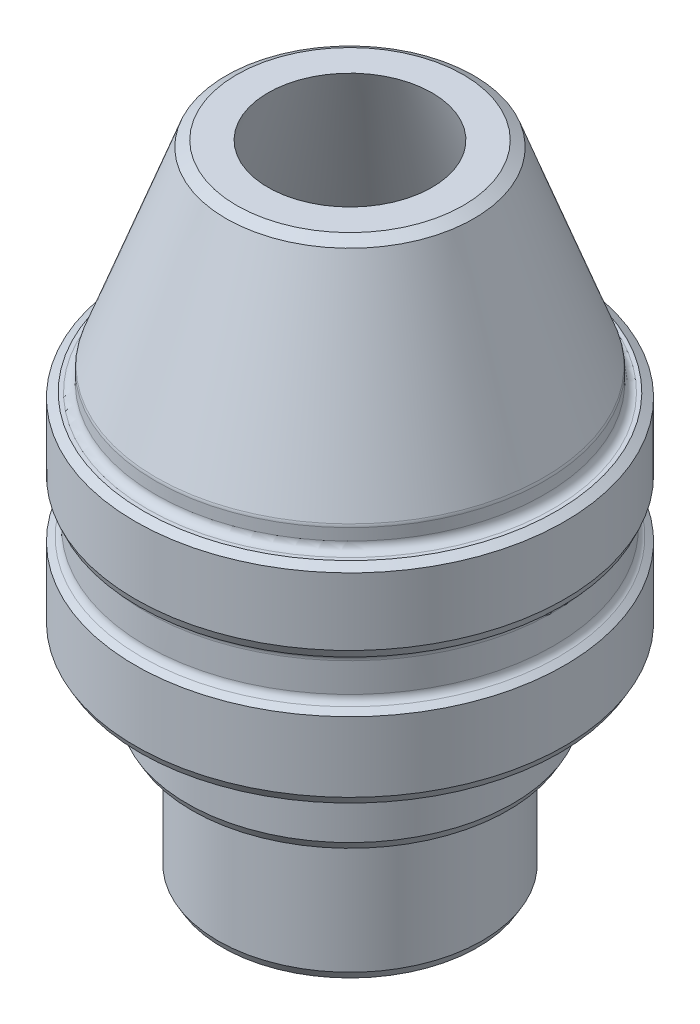
ISO-10303-21;
HEADER;
FILE_DESCRIPTION(('STEP AP214'),'2;1');
FILE_NAME('part.step','',(''),(''),'','','');
FILE_SCHEMA(('AUTOMOTIVE_DESIGN { 1 0 10303 214 1 1 1 1 }'));
ENDSEC;
DATA;
#1=APPLICATION_CONTEXT('core data for automotive mechanical design processes');
#2=APPLICATION_PROTOCOL_DEFINITION('international standard','automotive_design',2000,#1);
#3=PRODUCT_CONTEXT('',#1,'mechanical');
#4=PRODUCT('Part','Part','',(#3));
#5=PRODUCT_RELATED_PRODUCT_CATEGORY('part','',(#4));
#6=PRODUCT_DEFINITION_FORMATION('','',#4);
#7=PRODUCT_DEFINITION_CONTEXT('part definition',#1,'design');
#8=PRODUCT_DEFINITION('design','',#6,#7);
#9=PRODUCT_DEFINITION_SHAPE('','',#8);
#10=(LENGTH_UNIT() NAMED_UNIT(*) SI_UNIT(.MILLI.,.METRE.));
#11=(NAMED_UNIT(*) PLANE_ANGLE_UNIT() SI_UNIT($,.RADIAN.));
#12=(NAMED_UNIT(*) SI_UNIT($,.STERADIAN.) SOLID_ANGLE_UNIT());
#13=UNCERTAINTY_MEASURE_WITH_UNIT(LENGTH_MEASURE(1.E-05),#10,'distance_accuracy_value','');
#14=(GEOMETRIC_REPRESENTATION_CONTEXT(3) GLOBAL_UNCERTAINTY_ASSIGNED_CONTEXT((#13)) GLOBAL_UNIT_ASSIGNED_CONTEXT((#10,
#11,#12)) REPRESENTATION_CONTEXT('',''));
#15=CARTESIAN_POINT('',(0.,0.,0.));
#16=DIRECTION('',(0.,0.,1.));
#17=DIRECTION('',(1.,0.,0.));
#18=AXIS2_PLACEMENT_3D('',#15,#16,#17);
#19=CARTESIAN_POINT('',(4.318,22.5552,0.));
#20=DIRECTION('',(0.,1.,0.));
#21=DIRECTION('',(0.,0.,1.));
#22=AXIS2_PLACEMENT_3D('',#19,#20,#21);
#23=PLANE('',#22);
#24=CARTESIAN_POINT('',(0.,22.5552,0.));
#25=DIRECTION('',(0.,1.,0.));
#26=DIRECTION('',(0.,0.,1.));
#27=AXIS2_PLACEMENT_3D('',#24,#25,#26);
#28=CIRCLE('',#27,4.02265116279069);
#29=CARTESIAN_POINT('',(0.,22.5552,4.02265116279069));
#30=VERTEX_POINT('',#29);
#31=EDGE_CURVE('E10',#30,#30,#28,.T.);
#32=ORIENTED_EDGE('',*,*,#31,.T.);
#33=EDGE_LOOP('',(#32));
#34=FACE_BOUND('',#33,.T.);
#35=CARTESIAN_POINT('',(0.,22.5552,0.));
#36=DIRECTION('',(0.,-1.,0.));
#37=DIRECTION('',(0.,0.,-1.));
#38=AXIS2_PLACEMENT_3D('',#35,#36,#37);
#39=CIRCLE('',#38,2.91010643835145);
#40=CARTESIAN_POINT('',(0.,22.5552,-2.91010643835145));
#41=VERTEX_POINT('',#40);
#42=EDGE_CURVE('E110',#41,#41,#39,.T.);
#43=ORIENTED_EDGE('',*,*,#42,.T.);
#44=EDGE_LOOP('',(#43));
#45=FACE_BOUND('',#44,.T.);
#46=ADVANCED_FACE('F30',(#34,#45),#23,.T.);
#47=CARTESIAN_POINT('',(0.,22.5552,0.));
#48=DIRECTION('',(0.,-1.,0.));
#49=DIRECTION('',(0.,0.,-1.));
#50=AXIS2_PLACEMENT_3D('',#47,#48,#49);
#51=CONICAL_SURFACE('',#50,2.91010643835145,0.353580060069238);
#52=CARTESIAN_POINT('',(0.,15.5702,0.));
#53=DIRECTION('',(0.,-1.,0.));
#54=DIRECTION('',(0.,0.,-1.));
#55=AXIS2_PLACEMENT_3D('',#52,#53,#54);
#56=CIRCLE('',#55,5.48820643835145);
#57=CARTESIAN_POINT('',(0.,15.5702,-5.48820643835145));
#58=VERTEX_POINT('',#57);
#59=EDGE_CURVE('E113',#58,#58,#56,.T.);
#60=ORIENTED_EDGE('',*,*,#59,.T.);
#61=EDGE_LOOP('',(#60));
#62=FACE_BOUND('',#61,.T.);
#63=ORIENTED_EDGE('',*,*,#42,.F.);
#64=EDGE_LOOP('',(#63));
#65=FACE_BOUND('',#64,.T.);
#66=ADVANCED_FACE('F150',(#62,#65),#51,.F.);
#67=CARTESIAN_POINT('',(0.,0.,0.));
#68=DIRECTION('',(0.,-1.,0.));
#69=DIRECTION('',(0.,0.,-1.));
#70=AXIS2_PLACEMENT_3D('',#67,#68,#69);
#71=CYLINDRICAL_SURFACE('',#70,5.48820643835145);
#72=CARTESIAN_POINT('',(0.,8.69696307225261,0.));
#73=DIRECTION('',(0.,-1.,0.));
#74=DIRECTION('',(0.,0.,-1.));
#75=AXIS2_PLACEMENT_3D('',#72,#73,#74);
#76=CIRCLE('',#75,5.48820643835145);
#77=CARTESIAN_POINT('',(0.,8.69696307225261,-5.48820643835145));
#78=VERTEX_POINT('',#77);
#79=EDGE_CURVE('E116',#78,#78,#76,.T.);
#80=ORIENTED_EDGE('',*,*,#79,.T.);
#81=EDGE_LOOP('',(#80));
#82=FACE_BOUND('',#81,.T.);
#83=ORIENTED_EDGE('',*,*,#59,.F.);
#84=EDGE_LOOP('',(#83));
#85=FACE_BOUND('',#84,.T.);
#86=ADVANCED_FACE('F155',(#82,#85),#71,.F.);
#87=CARTESIAN_POINT('',(5.48820643835145,8.69696307225261,0.));
#88=DIRECTION('',(0.,1.,0.));
#89=DIRECTION('',(0.,0.,1.));
#90=AXIS2_PLACEMENT_3D('',#87,#88,#89);
#91=PLANE('',#90);
#92=CARTESIAN_POINT('',(0.,8.69696307225261,0.));
#93=DIRECTION('',(0.,-1.,0.));
#94=DIRECTION('',(0.,0.,-1.));
#95=AXIS2_PLACEMENT_3D('',#92,#93,#94);
#96=CIRCLE('',#95,3.3782);
#97=CARTESIAN_POINT('',(0.,8.69696307225261,-3.3782));
#98=VERTEX_POINT('',#97);
#99=EDGE_CURVE('E119',#98,#98,#96,.T.);
#100=ORIENTED_EDGE('',*,*,#99,.T.);
#101=EDGE_LOOP('',(#100));
#102=FACE_BOUND('',#101,.T.);
#103=ORIENTED_EDGE('',*,*,#79,.F.);
#104=EDGE_LOOP('',(#103));
#105=FACE_BOUND('',#104,.T.);
#106=ADVANCED_FACE('F356',(#102,#105),#91,.T.);
#107=CARTESIAN_POINT('',(0.,0.,0.));
#108=DIRECTION('',(0.,-1.,0.));
#109=DIRECTION('',(0.,0.,-1.));
#110=AXIS2_PLACEMENT_3D('',#107,#108,#109);
#111=CYLINDRICAL_SURFACE('',#110,3.3782);
#112=CARTESIAN_POINT('',(0.,0.,0.));
#113=DIRECTION('',(0.,-1.,0.));
#114=DIRECTION('',(0.,0.,-1.));
#115=AXIS2_PLACEMENT_3D('',#112,#113,#114);
#116=CIRCLE('',#115,3.3782);
#117=CARTESIAN_POINT('',(0.,0.,-3.3782));
#118=VERTEX_POINT('',#117);
#119=EDGE_CURVE('E122',#118,#118,#116,.T.);
#120=ORIENTED_EDGE('',*,*,#119,.T.);
#121=EDGE_LOOP('',(#120));
#122=FACE_BOUND('',#121,.T.);
#123=ORIENTED_EDGE('',*,*,#99,.F.);
#124=EDGE_LOOP('',(#123));
#125=FACE_BOUND('',#124,.T.);
#126=ADVANCED_FACE('F265',(#122,#125),#111,.F.);
#127=CARTESIAN_POINT('',(3.3782,0.,0.));
#128=DIRECTION('',(0.,-1.,0.));
#129=DIRECTION('',(0.,0.,-1.));
#130=AXIS2_PLACEMENT_3D('',#127,#128,#129);
#131=PLANE('',#130);
#132=CARTESIAN_POINT('',(0.,0.,0.));
#133=DIRECTION('',(0.,-1.,0.));
#134=DIRECTION('',(0.,0.,-1.));
#135=AXIS2_PLACEMENT_3D('',#132,#133,#134);
#136=CIRCLE('',#135,4.52848026933237);
#137=CARTESIAN_POINT('',(0.,0.,-4.52848026933237));
#138=VERTEX_POINT('',#137);
#139=EDGE_CURVE('E77',#138,#138,#136,.T.);
#140=ORIENTED_EDGE('',*,*,#139,.T.);
#141=EDGE_LOOP('',(#140));
#142=FACE_BOUND('',#141,.T.);
#143=ORIENTED_EDGE('',*,*,#119,.F.);
#144=EDGE_LOOP('',(#143));
#145=FACE_BOUND('',#144,.T.);
#146=ADVANCED_FACE('F307',(#142,#145),#131,.T.);
#147=CARTESIAN_POINT('',(0.,0.,0.));
#148=DIRECTION('',(0.,-1.,0.));
#149=DIRECTION('',(0.,0.,-1.));
#150=AXIS2_PLACEMENT_3D('',#147,#148,#149);
#151=CYLINDRICAL_SURFACE('',#150,4.699);
#152=CARTESIAN_POINT('',(0.,0.295348837209298,0.));
#153=DIRECTION('',(0.,-1.,0.));
#154=DIRECTION('',(0.,0.,-1.));
#155=AXIS2_PLACEMENT_3D('',#152,#153,#154);
#156=CIRCLE('',#155,4.699);
#157=CARTESIAN_POINT('',(0.,0.295348837209298,-4.699));
#158=VERTEX_POINT('',#157);
#159=EDGE_CURVE('E74',#158,#158,#156,.F.);
#160=ORIENTED_EDGE('',*,*,#159,.T.);
#161=EDGE_LOOP('',(#160));
#162=FACE_BOUND('',#161,.T.);
#163=CARTESIAN_POINT('',(0.,4.7498,0.));
#164=DIRECTION('',(0.,-1.,0.));
#165=DIRECTION('',(0.,0.,-1.));
#166=AXIS2_PLACEMENT_3D('',#163,#164,#165);
#167=CIRCLE('',#166,4.699);
#168=CARTESIAN_POINT('',(0.,4.7498,-4.699));
#169=VERTEX_POINT('',#168);
#170=EDGE_CURVE('E125',#169,#169,#167,.T.);
#171=ORIENTED_EDGE('',*,*,#170,.T.);
#172=EDGE_LOOP('',(#171));
#173=FACE_BOUND('',#172,.T.);
#174=ADVANCED_FACE('F312',(#162,#173),#151,.T.);
#175=CARTESIAN_POINT('',(5.7785,4.7498,0.));
#176=DIRECTION('',(0.,-1.,0.));
#177=DIRECTION('',(0.,0.,-1.));
#178=AXIS2_PLACEMENT_3D('',#175,#176,#177);
#179=PLANE('',#178);
#180=CARTESIAN_POINT('',(0.,4.7498,0.));
#181=DIRECTION('',(0.,-1.,0.));
#182=DIRECTION('',(0.,0.,-1.));
#183=AXIS2_PLACEMENT_3D('',#180,#181,#182);
#184=CIRCLE('',#183,5.60798026933236);
#185=CARTESIAN_POINT('',(0.,4.7498,-5.60798026933236));
#186=VERTEX_POINT('',#185);
#187=EDGE_CURVE('E71',#186,#186,#184,.T.);
#188=ORIENTED_EDGE('',*,*,#187,.T.);
#189=EDGE_LOOP('',(#188));
#190=FACE_BOUND('',#189,.T.);
#191=ORIENTED_EDGE('',*,*,#170,.F.);
#192=EDGE_LOOP('',(#191));
#193=FACE_BOUND('',#192,.T.);
#194=ADVANCED_FACE('F146',(#190,#193),#179,.T.);
#195=CARTESIAN_POINT('',(0.,0.,0.));
#196=DIRECTION('',(0.,-1.,0.));
#197=DIRECTION('',(0.,0.,-1.));
#198=AXIS2_PLACEMENT_3D('',#195,#196,#197);
#199=CYLINDRICAL_SURFACE('',#198,5.7785);
#200=CARTESIAN_POINT('',(0.,5.04514883720932,0.));
#201=DIRECTION('',(0.,-1.,0.));
#202=DIRECTION('',(0.,0.,-1.));
#203=AXIS2_PLACEMENT_3D('',#200,#201,#202);
#204=CIRCLE('',#203,5.7785);
#205=CARTESIAN_POINT('',(0.,5.04514883720932,-5.7785));
#206=VERTEX_POINT('',#205);
#207=EDGE_CURVE('E68',#206,#206,#204,.F.);
#208=ORIENTED_EDGE('',*,*,#207,.T.);
#209=EDGE_LOOP('',(#208));
#210=FACE_BOUND('',#209,.T.);
#211=CARTESIAN_POINT('',(0.,6.5278,0.));
#212=DIRECTION('',(0.,-1.,0.));
#213=DIRECTION('',(0.,0.,-1.));
#214=AXIS2_PLACEMENT_3D('',#211,#212,#213);
#215=CIRCLE('',#214,5.7785);
#216=CARTESIAN_POINT('',(0.,6.5278,-5.7785));
#217=VERTEX_POINT('',#216);
#218=EDGE_CURVE('E128',#217,#217,#215,.T.);
#219=ORIENTED_EDGE('',*,*,#218,.T.);
#220=EDGE_LOOP('',(#219));
#221=FACE_BOUND('',#220,.T.);
#222=ADVANCED_FACE('F132',(#210,#221),#199,.T.);
#223=CARTESIAN_POINT('',(6.223,6.5278,0.));
#224=DIRECTION('',(0.,-1.,0.));
#225=DIRECTION('',(0.,0.,-1.));
#226=AXIS2_PLACEMENT_3D('',#223,#224,#225);
#227=PLANE('',#226);
#228=CARTESIAN_POINT('',(0.,6.5278,0.));
#229=DIRECTION('',(0.,-1.,0.));
#230=DIRECTION('',(0.,0.,-1.));
#231=AXIS2_PLACEMENT_3D('',#228,#229,#230);
#232=CIRCLE('',#231,6.05248026933236);
#233=CARTESIAN_POINT('',(0.,6.5278,-6.05248026933236));
#234=VERTEX_POINT('',#233);
#235=EDGE_CURVE('E83',#234,#234,#232,.T.);
#236=ORIENTED_EDGE('',*,*,#235,.T.);
#237=EDGE_LOOP('',(#236));
#238=FACE_BOUND('',#237,.T.);
#239=ORIENTED_EDGE('',*,*,#218,.F.);
#240=EDGE_LOOP('',(#239));
#241=FACE_BOUND('',#240,.T.);
#242=ADVANCED_FACE('F134',(#238,#241),#227,.T.);
#243=CARTESIAN_POINT('',(0.,0.,0.));
#244=DIRECTION('',(0.,-1.,0.));
#245=DIRECTION('',(0.,0.,-1.));
#246=AXIS2_PLACEMENT_3D('',#243,#244,#245);
#247=CYLINDRICAL_SURFACE('',#246,6.223);
#248=CARTESIAN_POINT('',(0.,6.8231488372093,0.));
#249=DIRECTION('',(0.,-1.,0.));
#250=DIRECTION('',(0.,0.,-1.));
#251=AXIS2_PLACEMENT_3D('',#248,#249,#250);
#252=CIRCLE('',#251,6.223);
#253=CARTESIAN_POINT('',(0.,6.8231488372093,-6.223));
#254=VERTEX_POINT('',#253);
#255=EDGE_CURVE('E80',#254,#254,#252,.F.);
#256=ORIENTED_EDGE('',*,*,#255,.T.);
#257=EDGE_LOOP('',(#256));
#258=FACE_BOUND('',#257,.T.);
#259=CARTESIAN_POINT('',(0.,7.1468511627907,0.));
#260=DIRECTION('',(0.,-1.,0.));
#261=DIRECTION('',(0.,0.,-1.));
#262=AXIS2_PLACEMENT_3D('',#259,#260,#261);
#263=CIRCLE('',#262,6.223);
#264=CARTESIAN_POINT('',(0.,7.1468511627907,-6.223));
#265=VERTEX_POINT('',#264);
#266=EDGE_CURVE('E107',#265,#265,#263,.T.);
#267=ORIENTED_EDGE('',*,*,#266,.T.);
#268=EDGE_LOOP('',(#267));
#269=FACE_BOUND('',#268,.T.);
#270=ADVANCED_FACE('F136',(#258,#269),#247,.T.);
#271=CARTESIAN_POINT('',(7.62,7.4422,0.));
#272=DIRECTION('',(0.,-1.,0.));
#273=DIRECTION('',(0.,0.,-1.));
#274=AXIS2_PLACEMENT_3D('',#271,#272,#273);
#275=PLANE('',#274);
#276=CARTESIAN_POINT('',(0.,7.4422,0.));
#277=DIRECTION('',(0.,-1.,0.));
#278=DIRECTION('',(0.,0.,-1.));
#279=AXIS2_PLACEMENT_3D('',#276,#277,#278);
#280=CIRCLE('',#279,7.44948026933236);
#281=CARTESIAN_POINT('',(0.,7.4422,-7.44948026933236));
#282=VERTEX_POINT('',#281);
#283=EDGE_CURVE('E65',#282,#282,#280,.T.);
#284=ORIENTED_EDGE('',*,*,#283,.T.);
#285=EDGE_LOOP('',(#284));
#286=FACE_BOUND('',#285,.T.);
#287=CARTESIAN_POINT('',(0.,7.4422,0.));
#288=DIRECTION('',(0.,-1.,0.));
#289=DIRECTION('',(0.,0.,-1.));
#290=AXIS2_PLACEMENT_3D('',#287,#288,#289);
#291=CIRCLE('',#290,6.5183488372093);
#292=CARTESIAN_POINT('',(0.,7.4422,-6.5183488372093));
#293=VERTEX_POINT('',#292);
#294=EDGE_CURVE('E104',#293,#293,#291,.F.);
#295=ORIENTED_EDGE('',*,*,#294,.T.);
#296=EDGE_LOOP('',(#295));
#297=FACE_BOUND('',#296,.T.);
#298=ADVANCED_FACE('F143',(#286,#297),#275,.T.);
#299=CARTESIAN_POINT('',(0.,0.,0.));
#300=DIRECTION('',(0.,-1.,0.));
#301=DIRECTION('',(0.,0.,-1.));
#302=AXIS2_PLACEMENT_3D('',#299,#300,#301);
#303=CYLINDRICAL_SURFACE('',#302,7.62);
#304=CARTESIAN_POINT('',(0.,7.7375488372093,0.));
#305=DIRECTION('',(0.,-1.,0.));
#306=DIRECTION('',(0.,0.,-1.));
#307=AXIS2_PLACEMENT_3D('',#304,#305,#306);
#308=CIRCLE('',#307,7.62);
#309=CARTESIAN_POINT('',(0.,7.7375488372093,-7.62));
#310=VERTEX_POINT('',#309);
#311=EDGE_CURVE('E59',#310,#310,#308,.F.);
#312=ORIENTED_EDGE('',*,*,#311,.T.);
#313=EDGE_LOOP('',(#312));
#314=FACE_BOUND('',#313,.T.);
#315=CARTESIAN_POINT('',(0.,10.2171435393114,0.));
#316=DIRECTION('',(0.,-1.,0.));
#317=DIRECTION('',(0.,0.,-1.));
#318=AXIS2_PLACEMENT_3D('',#315,#316,#317);
#319=CIRCLE('',#318,7.62);
#320=CARTESIAN_POINT('',(0.,10.2171435393114,-7.62));
#321=VERTEX_POINT('',#320);
#322=EDGE_CURVE('E62',#321,#321,#319,.T.);
#323=ORIENTED_EDGE('',*,*,#322,.T.);
#324=EDGE_LOOP('',(#323));
#325=FACE_BOUND('',#324,.T.);
#326=ADVANCED_FACE('F229',(#314,#325),#303,.T.);
#327=CARTESIAN_POINT('',(0.,0.,0.));
#328=DIRECTION('',(0.,-1.,0.));
#329=DIRECTION('',(0.,0.,-1.));
#330=AXIS2_PLACEMENT_3D('',#327,#328,#329);
#331=CYLINDRICAL_SURFACE('',#330,7.239);
#332=CARTESIAN_POINT('',(0.,11.6680511627907,0.));
#333=DIRECTION('',(0.,-1.,0.));
#334=DIRECTION('',(0.,0.,-1.));
#335=AXIS2_PLACEMENT_3D('',#332,#333,#334);
#336=CIRCLE('',#335,7.239);
#337=CARTESIAN_POINT('',(0.,11.6680511627907,-7.239));
#338=VERTEX_POINT('',#337);
#339=EDGE_CURVE('E89',#338,#338,#336,.T.);
#340=ORIENTED_EDGE('',*,*,#339,.T.);
#341=EDGE_LOOP('',(#340));
#342=FACE_BOUND('',#341,.T.);
#343=CARTESIAN_POINT('',(0.,10.6331488372093,0.));
#344=DIRECTION('',(0.,1.,0.));
#345=DIRECTION('',(0.,0.,1.));
#346=AXIS2_PLACEMENT_3D('',#343,#344,#345);
#347=CIRCLE('',#346,7.239);
#348=CARTESIAN_POINT('',(0.,10.6331488372093,7.239));
#349=VERTEX_POINT('',#348);
#350=EDGE_CURVE('E92',#349,#349,#347,.T.);
#351=ORIENTED_EDGE('',*,*,#350,.T.);
#352=EDGE_LOOP('',(#351));
#353=FACE_BOUND('',#352,.T.);
#354=ADVANCED_FACE('F219',(#342,#353),#331,.T.);
#355=CARTESIAN_POINT('',(0.,0.,0.));
#356=DIRECTION('',(0.,-1.,0.));
#357=DIRECTION('',(0.,0.,-1.));
#358=AXIS2_PLACEMENT_3D('',#355,#356,#357);
#359=CYLINDRICAL_SURFACE('',#358,7.62);
#360=CARTESIAN_POINT('',(0.,12.252620293647,0.));
#361=DIRECTION('',(0.,1.,0.));
#362=DIRECTION('',(0.,0.,1.));
#363=AXIS2_PLACEMENT_3D('',#360,#361,#362);
#364=CIRCLE('',#363,7.62);
#365=CARTESIAN_POINT('',(0.,12.252620293647,7.62));
#366=VERTEX_POINT('',#365);
#367=EDGE_CURVE('E45',#366,#366,#364,.T.);
#368=ORIENTED_EDGE('',*,*,#367,.T.);
#369=EDGE_LOOP('',(#368));
#370=FACE_BOUND('',#369,.T.);
#371=CARTESIAN_POINT('',(0.,14.6376802693324,0.));
#372=DIRECTION('',(0.,1.,0.));
#373=DIRECTION('',(0.,0.,1.));
#374=AXIS2_PLACEMENT_3D('',#371,#372,#373);
#375=CIRCLE('',#374,7.62);
#376=CARTESIAN_POINT('',(0.,14.6376802693324,7.62));
#377=VERTEX_POINT('',#376);
#378=EDGE_CURVE('E50',#377,#377,#375,.F.);
#379=ORIENTED_EDGE('',*,*,#378,.T.);
#380=EDGE_LOOP('',(#379));
#381=FACE_BOUND('',#380,.T.);
#382=ADVANCED_FACE('F216',(#370,#381),#359,.T.);
#383=CARTESIAN_POINT('',(6.8961,14.8082,0.));
#384=DIRECTION('',(0.,1.,0.));
#385=DIRECTION('',(0.,0.,1.));
#386=AXIS2_PLACEMENT_3D('',#383,#384,#385);
#387=PLANE('',#386);
#388=CARTESIAN_POINT('',(0.,14.8082,0.));
#389=DIRECTION('',(0.,1.,0.));
#390=DIRECTION('',(0.,0.,1.));
#391=AXIS2_PLACEMENT_3D('',#388,#389,#390);
#392=CIRCLE('',#391,7.3246511627907);
#393=CARTESIAN_POINT('',(0.,14.8082,7.3246511627907));
#394=VERTEX_POINT('',#393);
#395=EDGE_CURVE('E41',#394,#394,#392,.T.);
#396=ORIENTED_EDGE('',*,*,#395,.T.);
#397=EDGE_LOOP('',(#396));
#398=FACE_BOUND('',#397,.T.);
#399=CARTESIAN_POINT('',(0.,14.8082,0.));
#400=DIRECTION('',(0.,1.,0.));
#401=DIRECTION('',(0.,0.,1.));
#402=AXIS2_PLACEMENT_3D('',#399,#400,#401);
#403=CIRCLE('',#402,7.1914488372093);
#404=CARTESIAN_POINT('',(0.,14.8082,7.1914488372093));
#405=VERTEX_POINT('',#404);
#406=EDGE_CURVE('E101',#405,#405,#403,.F.);
#407=ORIENTED_EDGE('',*,*,#406,.T.);
#408=EDGE_LOOP('',(#407));
#409=FACE_BOUND('',#408,.T.);
#410=ADVANCED_FACE('F218',(#398,#409),#387,.T.);
#411=CARTESIAN_POINT('',(0.,0.,0.));
#412=DIRECTION('',(0.,-1.,0.));
#413=DIRECTION('',(0.,0.,-1.));
#414=AXIS2_PLACEMENT_3D('',#411,#412,#413);
#415=CYLINDRICAL_SURFACE('',#414,6.8961);
#416=CARTESIAN_POINT('',(0.,15.1035488372093,0.));
#417=DIRECTION('',(0.,1.,0.));
#418=DIRECTION('',(0.,0.,1.));
#419=AXIS2_PLACEMENT_3D('',#416,#417,#418);
#420=CIRCLE('',#419,6.8961);
#421=CARTESIAN_POINT('',(0.,15.1035488372093,6.8961));
#422=VERTEX_POINT('',#421);
#423=EDGE_CURVE('E95',#422,#422,#420,.T.);
#424=ORIENTED_EDGE('',*,*,#423,.T.);
#425=EDGE_LOOP('',(#424));
#426=FACE_BOUND('',#425,.T.);
#427=CARTESIAN_POINT('',(0.,15.5174343967206,0.));
#428=DIRECTION('',(0.,1.,0.));
#429=DIRECTION('',(0.,0.,1.));
#430=AXIS2_PLACEMENT_3D('',#427,#428,#429);
#431=CIRCLE('',#430,6.8961);
#432=CARTESIAN_POINT('',(0.,15.5174343967206,6.8961));
#433=VERTEX_POINT('',#432);
#434=EDGE_CURVE('E98',#433,#433,#431,.F.);
#435=ORIENTED_EDGE('',*,*,#434,.T.);
#436=EDGE_LOOP('',(#435));
#437=FACE_BOUND('',#436,.T.);
#438=ADVANCED_FACE('F226',(#426,#437),#415,.T.);
#439=CARTESIAN_POINT('',(0.,15.5702,0.));
#440=DIRECTION('',(0.,-1.,0.));
#441=DIRECTION('',(0.,0.,-1.));
#442=AXIS2_PLACEMENT_3D('',#439,#440,#441);
#443=CONICAL_SURFACE('',#442,6.8961,0.353580060069238);
#444=CARTESIAN_POINT('',(0.,22.3385033550443,0.));
#445=DIRECTION('',(0.,1.,0.));
#446=DIRECTION('',(0.,0.,1.));
#447=AXIS2_PLACEMENT_3D('',#444,#445,#446);
#448=CIRCLE('',#447,4.39798076168364);
#449=CARTESIAN_POINT('',(0.,22.3385033550443,4.39798076168364));
#450=VERTEX_POINT('',#449);
#451=EDGE_CURVE('E37',#450,#450,#448,.F.);
#452=ORIENTED_EDGE('',*,*,#451,.T.);
#453=EDGE_LOOP('',(#452));
#454=FACE_BOUND('',#453,.T.);
#455=CARTESIAN_POINT('',(0.,15.6197014756157,0.));
#456=DIRECTION('',(0.,1.,0.));
#457=DIRECTION('',(0.,0.,1.));
#458=AXIS2_PLACEMENT_3D('',#455,#456,#457);
#459=CIRCLE('',#458,6.87782945536366);
#460=CARTESIAN_POINT('',(0.,15.6197014756157,6.87782945536366));
#461=VERTEX_POINT('',#460);
#462=EDGE_CURVE('E86',#461,#461,#459,.T.);
#463=ORIENTED_EDGE('',*,*,#462,.T.);
#464=EDGE_LOOP('',(#463));
#465=FACE_BOUND('',#464,.T.);
#466=ADVANCED_FACE('F165',(#454,#465),#443,.T.);
#467=CARTESIAN_POINT('',(0.,7.1468511627907,0.));
#468=DIRECTION('',(0.,-1.,0.));
#469=DIRECTION('',(0.,0.,-1.));
#470=AXIS2_PLACEMENT_3D('',#467,#468,#469);
#471=TOROIDAL_SURFACE('',#470,6.5183488372093,0.295348837209302);
#472=ORIENTED_EDGE('',*,*,#294,.F.);
#473=EDGE_LOOP('',(#472));
#474=FACE_BOUND('',#473,.T.);
#475=ORIENTED_EDGE('',*,*,#266,.F.);
#476=EDGE_LOOP('',(#475));
#477=FACE_BOUND('',#476,.T.);
#478=ADVANCED_FACE('F161',(#474,#477),#471,.F.);
#479=CARTESIAN_POINT('',(0.,15.1035488372093,0.));
#480=DIRECTION('',(0.,1.,0.));
#481=DIRECTION('',(0.,0.,1.));
#482=AXIS2_PLACEMENT_3D('',#479,#480,#481);
#483=TOROIDAL_SURFACE('',#482,7.1914488372093,0.295348837209302);
#484=ORIENTED_EDGE('',*,*,#423,.F.);
#485=EDGE_LOOP('',(#484));
#486=FACE_BOUND('',#485,.T.);
#487=ORIENTED_EDGE('',*,*,#406,.F.);
#488=EDGE_LOOP('',(#487));
#489=FACE_BOUND('',#488,.T.);
#490=ADVANCED_FACE('F164',(#486,#489),#483,.F.);
#491=CARTESIAN_POINT('',(0.,11.6680511627907,0.));
#492=DIRECTION('',(0.,-1.,0.));
#493=DIRECTION('',(0.,0.,-1.));
#494=AXIS2_PLACEMENT_3D('',#491,#492,#493);
#495=TOROIDAL_SURFACE('',#494,7.5343488372093,0.295348837209302);
#496=CARTESIAN_POINT('',(0.,11.9603357282197,0.));
#497=DIRECTION('',(0.,-1.,0.));
#498=DIRECTION('',(0.,0.,-1.));
#499=AXIS2_PLACEMENT_3D('',#496,#497,#498);
#500=CIRCLE('',#499,7.49191455327071);
#501=CARTESIAN_POINT('',(0.,11.9603357282197,-7.49191455327071));
#502=VERTEX_POINT('',#501);
#503=EDGE_CURVE('E53',#502,#502,#500,.T.);
#504=ORIENTED_EDGE('',*,*,#503,.T.);
#505=EDGE_LOOP('',(#504));
#506=FACE_BOUND('',#505,.T.);
#507=ORIENTED_EDGE('',*,*,#339,.F.);
#508=EDGE_LOOP('',(#507));
#509=FACE_BOUND('',#508,.T.);
#510=ADVANCED_FACE('F169',(#506,#509),#495,.F.);
#511=CARTESIAN_POINT('',(0.,10.6331488372093,0.));
#512=DIRECTION('',(0.,1.,0.));
#513=DIRECTION('',(0.,0.,1.));
#514=AXIS2_PLACEMENT_3D('',#511,#512,#513);
#515=TOROIDAL_SURFACE('',#514,7.5343488372093,0.295348837209302);
#516=CARTESIAN_POINT('',(0.,10.3694120464512,0.));
#517=DIRECTION('',(0.,1.,0.));
#518=DIRECTION('',(0.,0.,1.));
#519=AXIS2_PLACEMENT_3D('',#516,#517,#518);
#520=CIRCLE('',#519,7.40140583874255);
#521=CARTESIAN_POINT('',(0.,10.3694120464512,7.40140583874255));
#522=VERTEX_POINT('',#521);
#523=EDGE_CURVE('E56',#522,#522,#520,.T.);
#524=ORIENTED_EDGE('',*,*,#523,.T.);
#525=EDGE_LOOP('',(#524));
#526=FACE_BOUND('',#525,.T.);
#527=ORIENTED_EDGE('',*,*,#350,.F.);
#528=EDGE_LOOP('',(#527));
#529=FACE_BOUND('',#528,.T.);
#530=ADVANCED_FACE('F173',(#526,#529),#515,.F.);
#531=CARTESIAN_POINT('',(0.,15.5174343967206,0.));
#532=DIRECTION('',(0.,1.,0.));
#533=DIRECTION('',(0.,0.,1.));
#534=AXIS2_PLACEMENT_3D('',#531,#532,#533);
#535=TOROIDAL_SURFACE('',#534,6.6007511627907,0.295348837209302);
#536=ORIENTED_EDGE('',*,*,#462,.F.);
#537=EDGE_LOOP('',(#536));
#538=FACE_BOUND('',#537,.T.);
#539=ORIENTED_EDGE('',*,*,#434,.F.);
#540=EDGE_LOOP('',(#539));
#541=FACE_BOUND('',#540,.T.);
#542=ADVANCED_FACE('F177',(#538,#541),#535,.T.);
#543=CARTESIAN_POINT('',(0.,6.5278,0.));
#544=DIRECTION('',(0.,1.,0.));
#545=DIRECTION('',(0.,0.,1.));
#546=AXIS2_PLACEMENT_3D('',#543,#544,#545);
#547=CONICAL_SURFACE('',#546,6.05248026933236,0.523598775598299);
#548=ORIENTED_EDGE('',*,*,#255,.F.);
#549=EDGE_LOOP('',(#548));
#550=FACE_BOUND('',#549,.T.);
#551=ORIENTED_EDGE('',*,*,#235,.F.);
#552=EDGE_LOOP('',(#551));
#553=FACE_BOUND('',#552,.T.);
#554=ADVANCED_FACE('F181',(#550,#553),#547,.T.);
#555=CARTESIAN_POINT('',(0.,0.,0.));
#556=DIRECTION('',(0.,1.,0.));
#557=DIRECTION('',(0.,0.,1.));
#558=AXIS2_PLACEMENT_3D('',#555,#556,#557);
#559=CONICAL_SURFACE('',#558,4.52848026933237,0.523598775598296);
#560=ORIENTED_EDGE('',*,*,#159,.F.);
#561=EDGE_LOOP('',(#560));
#562=FACE_BOUND('',#561,.T.);
#563=ORIENTED_EDGE('',*,*,#139,.F.);
#564=EDGE_LOOP('',(#563));
#565=FACE_BOUND('',#564,.T.);
#566=ADVANCED_FACE('F185',(#562,#565),#559,.T.);
#567=CARTESIAN_POINT('',(0.,4.7498,0.));
#568=DIRECTION('',(0.,1.,0.));
#569=DIRECTION('',(0.,0.,1.));
#570=AXIS2_PLACEMENT_3D('',#567,#568,#569);
#571=CONICAL_SURFACE('',#570,5.60798026933236,0.523598775598299);
#572=ORIENTED_EDGE('',*,*,#207,.F.);
#573=EDGE_LOOP('',(#572));
#574=FACE_BOUND('',#573,.T.);
#575=ORIENTED_EDGE('',*,*,#187,.F.);
#576=EDGE_LOOP('',(#575));
#577=FACE_BOUND('',#576,.T.);
#578=ADVANCED_FACE('F189',(#574,#577),#571,.T.);
#579=CARTESIAN_POINT('',(0.,7.4422,0.));
#580=DIRECTION('',(0.,1.,0.));
#581=DIRECTION('',(0.,0.,1.));
#582=AXIS2_PLACEMENT_3D('',#579,#580,#581);
#583=CONICAL_SURFACE('',#582,7.44948026933236,0.523598775598303);
#584=ORIENTED_EDGE('',*,*,#311,.F.);
#585=EDGE_LOOP('',(#584));
#586=FACE_BOUND('',#585,.T.);
#587=ORIENTED_EDGE('',*,*,#283,.F.);
#588=EDGE_LOOP('',(#587));
#589=FACE_BOUND('',#588,.T.);
#590=ADVANCED_FACE('F193',(#586,#589),#583,.T.);
#591=CARTESIAN_POINT('',(0.,10.2171435393114,0.));
#592=DIRECTION('',(0.,-1.,0.));
#593=DIRECTION('',(0.,0.,-1.));
#594=AXIS2_PLACEMENT_3D('',#591,#592,#593);
#595=CONICAL_SURFACE('',#594,7.62,0.962368780391405);
#596=ORIENTED_EDGE('',*,*,#523,.F.);
#597=EDGE_LOOP('',(#596));
#598=FACE_BOUND('',#597,.T.);
#599=ORIENTED_EDGE('',*,*,#322,.F.);
#600=EDGE_LOOP('',(#599));
#601=FACE_BOUND('',#600,.T.);
#602=ADVANCED_FACE('F197',(#598,#601),#595,.T.);
#603=CARTESIAN_POINT('',(0.,11.9603357282188,0.));
#604=DIRECTION('',(0.,1.,0.));
#605=DIRECTION('',(0.,0.,1.));
#606=AXIS2_PLACEMENT_3D('',#603,#604,#605);
#607=CONICAL_SURFACE('',#606,7.49191455327083,0.41301605754996);
#608=ORIENTED_EDGE('',*,*,#367,.F.);
#609=EDGE_LOOP('',(#608));
#610=FACE_BOUND('',#609,.T.);
#611=ORIENTED_EDGE('',*,*,#503,.F.);
#612=EDGE_LOOP('',(#611));
#613=FACE_BOUND('',#612,.T.);
#614=ADVANCED_FACE('F201',(#610,#613),#607,.T.);
#615=CARTESIAN_POINT('',(0.,14.6376802693324,0.));
#616=DIRECTION('',(0.,-1.,0.));
#617=DIRECTION('',(0.,0.,-1.));
#618=AXIS2_PLACEMENT_3D('',#615,#616,#617);
#619=CONICAL_SURFACE('',#618,7.62,1.0471975511966);
#620=ORIENTED_EDGE('',*,*,#395,.F.);
#621=EDGE_LOOP('',(#620));
#622=FACE_BOUND('',#621,.T.);
#623=ORIENTED_EDGE('',*,*,#378,.F.);
#624=EDGE_LOOP('',(#623));
#625=FACE_BOUND('',#624,.T.);
#626=ADVANCED_FACE('F204',(#622,#625),#619,.T.);
#627=CARTESIAN_POINT('',(0.,22.3385033550443,0.));
#628=DIRECTION('',(0.,-1.,0.));
#629=DIRECTION('',(0.,0.,-1.));
#630=AXIS2_PLACEMENT_3D('',#627,#628,#629);
#631=CONICAL_SURFACE('',#630,4.39798076168364,1.04719755119659);
#632=ORIENTED_EDGE('',*,*,#31,.F.);
#633=EDGE_LOOP('',(#632));
#634=FACE_BOUND('',#633,.T.);
#635=ORIENTED_EDGE('',*,*,#451,.F.);
#636=EDGE_LOOP('',(#635));
#637=FACE_BOUND('',#636,.T.);
#638=ADVANCED_FACE('F32',(#634,#637),#631,.T.);
#639=CLOSED_SHELL('',(#46,#66,#86,#106,#126,#146,#174,#194,#222,#242,#270,#298,#326,#354,#382,
#410,#438,#466,#478,#490,#510,#530,#542,#554,#566,#578,#590,#602,#614,#626,#638));
#640=MANIFOLD_SOLID_BREP('B2',#639);
#641=ADVANCED_BREP_SHAPE_REPRESENTATION('',(#18,#640),#14);
#642=SHAPE_DEFINITION_REPRESENTATION(#9,#641);
ENDSEC;
END-ISO-10303-21;
